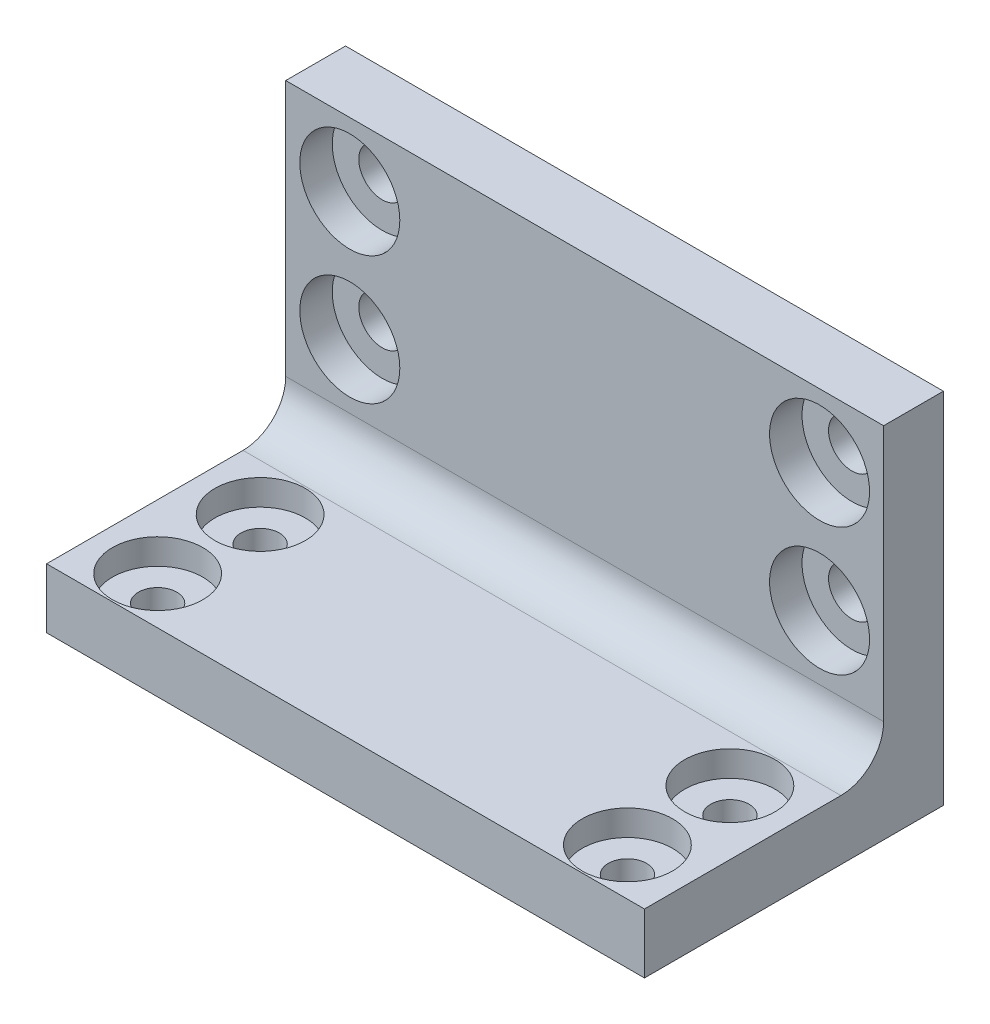
ISO-10303-21;
HEADER;
FILE_DESCRIPTION(('STEP AP214'),'2;1');
FILE_NAME('part.step','',(''),(''),'','','');
FILE_SCHEMA(('AUTOMOTIVE_DESIGN { 1 0 10303 214 1 1 1 1 }'));
ENDSEC;
DATA;
#1=APPLICATION_CONTEXT('core data for automotive mechanical design processes');
#2=APPLICATION_PROTOCOL_DEFINITION('international standard','automotive_design',2000,#1);
#3=PRODUCT_CONTEXT('',#1,'mechanical');
#4=PRODUCT('Part','Part','',(#3));
#5=PRODUCT_RELATED_PRODUCT_CATEGORY('part','',(#4));
#6=PRODUCT_DEFINITION_FORMATION('','',#4);
#7=PRODUCT_DEFINITION_CONTEXT('part definition',#1,'design');
#8=PRODUCT_DEFINITION('design','',#6,#7);
#9=PRODUCT_DEFINITION_SHAPE('','',#8);
#10=(LENGTH_UNIT() NAMED_UNIT(*) SI_UNIT(.MILLI.,.METRE.));
#11=(NAMED_UNIT(*) PLANE_ANGLE_UNIT() SI_UNIT($,.RADIAN.));
#12=(NAMED_UNIT(*) SI_UNIT($,.STERADIAN.) SOLID_ANGLE_UNIT());
#13=UNCERTAINTY_MEASURE_WITH_UNIT(LENGTH_MEASURE(1.E-05),#10,'distance_accuracy_value','');
#14=(GEOMETRIC_REPRESENTATION_CONTEXT(3) GLOBAL_UNCERTAINTY_ASSIGNED_CONTEXT((#13)) GLOBAL_UNIT_ASSIGNED_CONTEXT((#10,
#11,#12)) REPRESENTATION_CONTEXT('',''));
#15=CARTESIAN_POINT('',(0.,0.,0.));
#16=DIRECTION('',(0.,0.,1.));
#17=DIRECTION('',(1.,0.,0.));
#18=AXIS2_PLACEMENT_3D('',#15,#16,#17);
#19=CARTESIAN_POINT('',(-34.9999999999999,7.,35.0000000000001));
#20=DIRECTION('',(1.,0.,0.));
#21=DIRECTION('',(0.,0.,-1.));
#22=AXIS2_PLACEMENT_3D('',#19,#20,#21);
#23=PLANE('',#22);
#24=DIRECTION('',(0.,0.,1.));
#25=VECTOR('',#24,1.);
#26=CARTESIAN_POINT('',(-34.9999999999999,0.,35.0000000000001));
#27=LINE('',#26,#25);
#28=CARTESIAN_POINT('',(-34.9999999999999,0.,1.088711004442E-13));
#29=VERTEX_POINT('',#28);
#30=CARTESIAN_POINT('',(-34.9999999999999,0.,35.0000000000001));
#31=VERTEX_POINT('',#30);
#32=EDGE_CURVE('E116',#29,#31,#27,.T.);
#33=ORIENTED_EDGE('',*,*,#32,.T.);
#34=DIRECTION('',(0.,-1.,0.));
#35=VECTOR('',#34,1.);
#36=CARTESIAN_POINT('',(-34.9999999999999,7.,35.0000000000001));
#37=LINE('',#36,#35);
#38=CARTESIAN_POINT('',(-34.9999999999999,7.,35.0000000000001));
#39=VERTEX_POINT('',#38);
#40=EDGE_CURVE('E142',#39,#31,#37,.T.);
#41=ORIENTED_EDGE('',*,*,#40,.F.);
#42=DIRECTION('',(0.,0.,1.));
#43=VECTOR('',#42,1.);
#44=CARTESIAN_POINT('',(-34.9999999999999,7.,35.0000000000001));
#45=LINE('',#44,#43);
#46=CARTESIAN_POINT('',(-34.9999999999999,7.,12.0000000000001));
#47=VERTEX_POINT('',#46);
#48=EDGE_CURVE('E123',#47,#39,#45,.T.);
#49=ORIENTED_EDGE('',*,*,#48,.F.);
#50=CARTESIAN_POINT('',(-34.9999999999999,12.,12.0000000000001));
#51=DIRECTION('',(1.,0.,0.));
#52=DIRECTION('',(0.,0.,-1.));
#53=AXIS2_PLACEMENT_3D('',#50,#51,#52);
#54=CIRCLE('',#53,5.);
#55=CARTESIAN_POINT('',(-34.9999999999999,12.,7.00000000000011));
#56=VERTEX_POINT('',#55);
#57=EDGE_CURVE('E11',#47,#56,#54,.T.);
#58=ORIENTED_EDGE('',*,*,#57,.T.);
#59=DIRECTION('',(0.,-1.,0.));
#60=VECTOR('',#59,1.);
#61=CARTESIAN_POINT('',(-34.9999999999999,42.,7.00000000000011));
#62=LINE('',#61,#60);
#63=CARTESIAN_POINT('',(-34.9999999999999,42.,7.00000000000011));
#64=VERTEX_POINT('',#63);
#65=EDGE_CURVE('E96',#64,#56,#62,.T.);
#66=ORIENTED_EDGE('',*,*,#65,.F.);
#67=DIRECTION('',(0.,0.,1.));
#68=VECTOR('',#67,1.);
#69=CARTESIAN_POINT('',(-34.9999999999999,42.,7.00000000000011));
#70=LINE('',#69,#68);
#71=CARTESIAN_POINT('',(-34.9999999999999,42.,1.088711004442E-13));
#72=VERTEX_POINT('',#71);
#73=EDGE_CURVE('E103',#72,#64,#70,.T.);
#74=ORIENTED_EDGE('',*,*,#73,.F.);
#75=DIRECTION('',(0.,-1.,0.));
#76=VECTOR('',#75,1.);
#77=CARTESIAN_POINT('',(-34.9999999999999,7.,1.088711004442E-13));
#78=LINE('',#77,#76);
#79=EDGE_CURVE('E129',#72,#29,#78,.T.);
#80=ORIENTED_EDGE('',*,*,#79,.T.);
#81=EDGE_LOOP('',(#33,#41,#49,#58,#66,#74,#80));
#82=FACE_BOUND('',#81,.T.);
#83=ADVANCED_FACE('F33',(#82),#23,.F.);
#84=CARTESIAN_POINT('',(35.0000000000001,7.,35.0000000000001));
#85=DIRECTION('',(0.,0.,-1.));
#86=DIRECTION('',(-1.,0.,0.));
#87=AXIS2_PLACEMENT_3D('',#84,#85,#86);
#88=PLANE('',#87);
#89=DIRECTION('',(1.,0.,0.));
#90=VECTOR('',#89,1.);
#91=CARTESIAN_POINT('',(35.0000000000001,0.,35.0000000000001));
#92=LINE('',#91,#90);
#93=CARTESIAN_POINT('',(35.0000000000001,0.,35.0000000000001));
#94=VERTEX_POINT('',#93);
#95=EDGE_CURVE('E118',#31,#94,#92,.T.);
#96=ORIENTED_EDGE('',*,*,#95,.T.);
#97=DIRECTION('',(0.,-1.,0.));
#98=VECTOR('',#97,1.);
#99=CARTESIAN_POINT('',(35.0000000000001,7.,35.0000000000001));
#100=LINE('',#99,#98);
#101=CARTESIAN_POINT('',(35.0000000000001,7.,35.0000000000001));
#102=VERTEX_POINT('',#101);
#103=EDGE_CURVE('E139',#102,#94,#100,.T.);
#104=ORIENTED_EDGE('',*,*,#103,.F.);
#105=DIRECTION('',(1.,0.,0.));
#106=VECTOR('',#105,1.);
#107=CARTESIAN_POINT('',(35.0000000000001,7.,35.0000000000001));
#108=LINE('',#107,#106);
#109=EDGE_CURVE('E125',#39,#102,#108,.T.);
#110=ORIENTED_EDGE('',*,*,#109,.F.);
#111=ORIENTED_EDGE('',*,*,#40,.T.);
#112=EDGE_LOOP('',(#96,#104,#110,#111));
#113=FACE_BOUND('',#112,.T.);
#114=ADVANCED_FACE('F273',(#113),#88,.F.);
#115=CARTESIAN_POINT('',(35.0000000000001,7.,35.0000000000001));
#116=DIRECTION('',(-1.,0.,0.));
#117=DIRECTION('',(0.,0.,1.));
#118=AXIS2_PLACEMENT_3D('',#115,#116,#117);
#119=PLANE('',#118);
#120=DIRECTION('',(0.,0.,-1.));
#121=VECTOR('',#120,1.);
#122=CARTESIAN_POINT('',(35.0000000000001,0.,35.0000000000001));
#123=LINE('',#122,#121);
#124=CARTESIAN_POINT('',(35.0000000000001,0.,1.00298572850168E-13));
#125=VERTEX_POINT('',#124);
#126=EDGE_CURVE('E132',#94,#125,#123,.T.);
#127=ORIENTED_EDGE('',*,*,#126,.T.);
#128=DIRECTION('',(0.,-1.,0.));
#129=VECTOR('',#128,1.);
#130=CARTESIAN_POINT('',(35.0000000000001,7.,1.00298572850168E-13));
#131=LINE('',#130,#129);
#132=CARTESIAN_POINT('',(34.9999999999999,42.,1.088711004442E-13));
#133=VERTEX_POINT('',#132);
#134=EDGE_CURVE('E136',#133,#125,#131,.T.);
#135=ORIENTED_EDGE('',*,*,#134,.F.);
#136=DIRECTION('',(0.,0.,-1.));
#137=VECTOR('',#136,1.);
#138=CARTESIAN_POINT('',(34.9999999999999,42.,7.0000000000001));
#139=LINE('',#138,#137);
#140=CARTESIAN_POINT('',(34.9999999999999,42.,7.0000000000001));
#141=VERTEX_POINT('',#140);
#142=EDGE_CURVE('E102',#141,#133,#139,.T.);
#143=ORIENTED_EDGE('',*,*,#142,.F.);
#144=DIRECTION('',(0.,-1.,0.));
#145=VECTOR('',#144,1.);
#146=CARTESIAN_POINT('',(34.9999999999999,42.,7.0000000000001));
#147=LINE('',#146,#145);
#148=CARTESIAN_POINT('',(34.9999999999999,12.,7.0000000000001));
#149=VERTEX_POINT('',#148);
#150=EDGE_CURVE('E98',#141,#149,#147,.T.);
#151=ORIENTED_EDGE('',*,*,#150,.T.);
#152=CARTESIAN_POINT('',(35.0000000000001,12.,12.0000000000001));
#153=DIRECTION('',(-1.,0.,0.));
#154=DIRECTION('',(0.,0.,1.));
#155=AXIS2_PLACEMENT_3D('',#152,#153,#154);
#156=CIRCLE('',#155,5.);
#157=CARTESIAN_POINT('',(35.0000000000001,7.,12.0000000000001));
#158=VERTEX_POINT('',#157);
#159=EDGE_CURVE('E41',#149,#158,#156,.T.);
#160=ORIENTED_EDGE('',*,*,#159,.T.);
#161=DIRECTION('',(0.,0.,-1.));
#162=VECTOR('',#161,1.);
#163=CARTESIAN_POINT('',(35.0000000000001,7.,35.0000000000001));
#164=LINE('',#163,#162);
#165=EDGE_CURVE('E128',#102,#158,#164,.T.);
#166=ORIENTED_EDGE('',*,*,#165,.F.);
#167=ORIENTED_EDGE('',*,*,#103,.T.);
#168=EDGE_LOOP('',(#127,#135,#143,#151,#160,#166,#167));
#169=FACE_BOUND('',#168,.T.);
#170=ADVANCED_FACE('F148',(#169),#119,.F.);
#171=CARTESIAN_POINT('',(35.0000000000001,7.,1.00298572850168E-13));
#172=DIRECTION('',(0.,0.,1.));
#173=DIRECTION('',(1.,0.,0.));
#174=AXIS2_PLACEMENT_3D('',#171,#172,#173);
#175=PLANE('',#174);
#176=CARTESIAN_POINT('',(-27.5,34.5,1.01481323344643E-13));
#177=DIRECTION('',(0.,0.,1.));
#178=DIRECTION('',(1.,0.,0.));
#179=AXIS2_PLACEMENT_3D('',#176,#177,#178);
#180=CIRCLE('',#179,2.75);
#181=CARTESIAN_POINT('',(-24.75,34.5,1.01481323344643E-13));
#182=VERTEX_POINT('',#181);
#183=EDGE_CURVE('E186',#182,#182,#180,.T.);
#184=ORIENTED_EDGE('',*,*,#183,.T.);
#185=EDGE_LOOP('',(#184));
#186=FACE_BOUND('',#185,.T.);
#187=CARTESIAN_POINT('',(27.5,34.5,1.01481323344643E-13));
#188=DIRECTION('',(0.,0.,1.));
#189=DIRECTION('',(1.,0.,0.));
#190=AXIS2_PLACEMENT_3D('',#187,#188,#189);
#191=CIRCLE('',#190,2.75);
#192=CARTESIAN_POINT('',(30.25,34.5,1.01481323344643E-13));
#193=VERTEX_POINT('',#192);
#194=EDGE_CURVE('E174',#193,#193,#191,.T.);
#195=ORIENTED_EDGE('',*,*,#194,.T.);
#196=EDGE_LOOP('',(#195));
#197=FACE_BOUND('',#196,.T.);
#198=CARTESIAN_POINT('',(27.5,19.5,1.01481323344643E-13));
#199=DIRECTION('',(0.,0.,1.));
#200=DIRECTION('',(1.,0.,0.));
#201=AXIS2_PLACEMENT_3D('',#198,#199,#200);
#202=CIRCLE('',#201,2.75);
#203=CARTESIAN_POINT('',(30.25,19.5,1.01481323344643E-13));
#204=VERTEX_POINT('',#203);
#205=EDGE_CURVE('E162',#204,#204,#202,.T.);
#206=ORIENTED_EDGE('',*,*,#205,.T.);
#207=EDGE_LOOP('',(#206));
#208=FACE_BOUND('',#207,.T.);
#209=CARTESIAN_POINT('',(-27.5,19.5,1.01481323344643E-13));
#210=DIRECTION('',(0.,0.,1.));
#211=DIRECTION('',(1.,0.,0.));
#212=AXIS2_PLACEMENT_3D('',#209,#210,#211);
#213=CIRCLE('',#212,2.75);
#214=CARTESIAN_POINT('',(-24.75,19.5,1.01481323344643E-13));
#215=VERTEX_POINT('',#214);
#216=EDGE_CURVE('E112',#215,#215,#213,.T.);
#217=ORIENTED_EDGE('',*,*,#216,.T.);
#218=EDGE_LOOP('',(#217));
#219=FACE_BOUND('',#218,.T.);
#220=DIRECTION('',(-1.,0.,0.));
#221=VECTOR('',#220,1.);
#222=CARTESIAN_POINT('',(35.0000000000001,0.,1.00298572850168E-13));
#223=LINE('',#222,#221);
#224=EDGE_CURVE('E126',#125,#29,#223,.T.);
#225=ORIENTED_EDGE('',*,*,#224,.T.);
#226=ORIENTED_EDGE('',*,*,#79,.F.);
#227=DIRECTION('',(-1.,0.,0.));
#228=VECTOR('',#227,1.);
#229=CARTESIAN_POINT('',(34.9999999999999,42.,1.088711004442E-13));
#230=LINE('',#229,#228);
#231=EDGE_CURVE('E109',#133,#72,#230,.T.);
#232=ORIENTED_EDGE('',*,*,#231,.F.);
#233=ORIENTED_EDGE('',*,*,#134,.T.);
#234=EDGE_LOOP('',(#225,#226,#232,#233));
#235=FACE_BOUND('',#234,.T.);
#236=ADVANCED_FACE('F253',(#186,#197,#208,#219,#235),#175,.F.);
#237=CARTESIAN_POINT('',(0.,7.,0.));
#238=DIRECTION('',(0.,1.,0.));
#239=DIRECTION('',(0.,0.,1.));
#240=AXIS2_PLACEMENT_3D('',#237,#238,#239);
#241=PLANE('',#240);
#242=CARTESIAN_POINT('',(-27.5,7.,17.5000000000001));
#243=DIRECTION('',(0.,1.,0.));
#244=DIRECTION('',(0.,0.,1.));
#245=AXIS2_PLACEMENT_3D('',#242,#243,#244);
#246=CIRCLE('',#245,5.295);
#247=CARTESIAN_POINT('',(-27.5,7.,22.7950000000001));
#248=VERTEX_POINT('',#247);
#249=EDGE_CURVE('E243',#248,#248,#246,.T.);
#250=ORIENTED_EDGE('',*,*,#249,.F.);
#251=EDGE_LOOP('',(#250));
#252=FACE_BOUND('',#251,.T.);
#253=CARTESIAN_POINT('',(-27.5,7.,29.5000000000001));
#254=DIRECTION('',(0.,1.,0.));
#255=DIRECTION('',(0.,0.,1.));
#256=AXIS2_PLACEMENT_3D('',#253,#254,#255);
#257=CIRCLE('',#256,5.295);
#258=CARTESIAN_POINT('',(-27.5,7.,34.7950000000001));
#259=VERTEX_POINT('',#258);
#260=EDGE_CURVE('E231',#259,#259,#257,.T.);
#261=ORIENTED_EDGE('',*,*,#260,.F.);
#262=EDGE_LOOP('',(#261));
#263=FACE_BOUND('',#262,.T.);
#264=CARTESIAN_POINT('',(27.5,7.,17.5000000000001));
#265=DIRECTION('',(0.,1.,0.));
#266=DIRECTION('',(0.,0.,1.));
#267=AXIS2_PLACEMENT_3D('',#264,#265,#266);
#268=CIRCLE('',#267,5.295);
#269=CARTESIAN_POINT('',(27.5,7.,22.7950000000001));
#270=VERTEX_POINT('',#269);
#271=EDGE_CURVE('E219',#270,#270,#268,.T.);
#272=ORIENTED_EDGE('',*,*,#271,.F.);
#273=EDGE_LOOP('',(#272));
#274=FACE_BOUND('',#273,.T.);
#275=CARTESIAN_POINT('',(27.5,7.,29.5000000000001));
#276=DIRECTION('',(0.,1.,0.));
#277=DIRECTION('',(0.,0.,1.));
#278=AXIS2_PLACEMENT_3D('',#275,#276,#277);
#279=CIRCLE('',#278,5.295);
#280=CARTESIAN_POINT('',(27.5,7.,34.7950000000001));
#281=VERTEX_POINT('',#280);
#282=EDGE_CURVE('E207',#281,#281,#279,.T.);
#283=ORIENTED_EDGE('',*,*,#282,.F.);
#284=EDGE_LOOP('',(#283));
#285=FACE_BOUND('',#284,.T.);
#286=ORIENTED_EDGE('',*,*,#165,.T.);
#287=DIRECTION('',(1.,0.,0.));
#288=VECTOR('',#287,1.);
#289=CARTESIAN_POINT('',(0.,7.,12.0000000000001));
#290=LINE('',#289,#288);
#291=EDGE_CURVE('E54',#158,#47,#290,.F.);
#292=ORIENTED_EDGE('',*,*,#291,.T.);
#293=ORIENTED_EDGE('',*,*,#48,.T.);
#294=ORIENTED_EDGE('',*,*,#109,.T.);
#295=EDGE_LOOP('',(#286,#292,#293,#294));
#296=FACE_BOUND('',#295,.T.);
#297=ADVANCED_FACE('F249',(#252,#263,#274,#285,#296),#241,.T.);
#298=CARTESIAN_POINT('',(0.,0.,0.));
#299=DIRECTION('',(0.,1.,0.));
#300=DIRECTION('',(0.,0.,1.));
#301=AXIS2_PLACEMENT_3D('',#298,#299,#300);
#302=PLANE('',#301);
#303=CARTESIAN_POINT('',(-27.5,0.,17.5000000000001));
#304=DIRECTION('',(0.,1.,0.));
#305=DIRECTION('',(0.,0.,1.));
#306=AXIS2_PLACEMENT_3D('',#303,#304,#305);
#307=CIRCLE('',#306,2.25);
#308=CARTESIAN_POINT('',(-27.5,0.,19.7500000000001));
#309=VERTEX_POINT('',#308);
#310=EDGE_CURVE('E234',#309,#309,#307,.T.);
#311=ORIENTED_EDGE('',*,*,#310,.T.);
#312=EDGE_LOOP('',(#311));
#313=FACE_BOUND('',#312,.T.);
#314=CARTESIAN_POINT('',(-27.5,0.,29.5000000000001));
#315=DIRECTION('',(0.,1.,0.));
#316=DIRECTION('',(0.,0.,1.));
#317=AXIS2_PLACEMENT_3D('',#314,#315,#316);
#318=CIRCLE('',#317,2.25);
#319=CARTESIAN_POINT('',(-27.5,0.,31.7500000000001));
#320=VERTEX_POINT('',#319);
#321=EDGE_CURVE('E222',#320,#320,#318,.T.);
#322=ORIENTED_EDGE('',*,*,#321,.T.);
#323=EDGE_LOOP('',(#322));
#324=FACE_BOUND('',#323,.T.);
#325=CARTESIAN_POINT('',(27.5,0.,17.5000000000001));
#326=DIRECTION('',(0.,1.,0.));
#327=DIRECTION('',(0.,0.,1.));
#328=AXIS2_PLACEMENT_3D('',#325,#326,#327);
#329=CIRCLE('',#328,2.25);
#330=CARTESIAN_POINT('',(27.5,0.,19.7500000000001));
#331=VERTEX_POINT('',#330);
#332=EDGE_CURVE('E210',#331,#331,#329,.T.);
#333=ORIENTED_EDGE('',*,*,#332,.T.);
#334=EDGE_LOOP('',(#333));
#335=FACE_BOUND('',#334,.T.);
#336=CARTESIAN_POINT('',(27.5,0.,29.5000000000001));
#337=DIRECTION('',(0.,1.,0.));
#338=DIRECTION('',(0.,0.,1.));
#339=AXIS2_PLACEMENT_3D('',#336,#337,#338);
#340=CIRCLE('',#339,2.25);
#341=CARTESIAN_POINT('',(27.5,0.,31.7500000000001));
#342=VERTEX_POINT('',#341);
#343=EDGE_CURVE('E198',#342,#342,#340,.T.);
#344=ORIENTED_EDGE('',*,*,#343,.T.);
#345=EDGE_LOOP('',(#344));
#346=FACE_BOUND('',#345,.T.);
#347=ORIENTED_EDGE('',*,*,#32,.F.);
#348=ORIENTED_EDGE('',*,*,#224,.F.);
#349=ORIENTED_EDGE('',*,*,#126,.F.);
#350=ORIENTED_EDGE('',*,*,#95,.F.);
#351=EDGE_LOOP('',(#347,#348,#349,#350));
#352=FACE_BOUND('',#351,.T.);
#353=ADVANCED_FACE('F252',(#313,#324,#335,#346,#352),#302,.F.);
#354=CARTESIAN_POINT('',(34.9999999999999,42.,7.0000000000001));
#355=DIRECTION('',(0.,0.,-1.));
#356=DIRECTION('',(-1.,0.,0.));
#357=AXIS2_PLACEMENT_3D('',#354,#355,#356);
#358=PLANE('',#357);
#359=CARTESIAN_POINT('',(-27.5,34.5,7.0000000000001));
#360=DIRECTION('',(0.,0.,1.));
#361=DIRECTION('',(1.,0.,0.));
#362=AXIS2_PLACEMENT_3D('',#359,#360,#361);
#363=CIRCLE('',#362,5.855);
#364=CARTESIAN_POINT('',(-21.645,34.5,7.0000000000001));
#365=VERTEX_POINT('',#364);
#366=EDGE_CURVE('E195',#365,#365,#363,.T.);
#367=ORIENTED_EDGE('',*,*,#366,.F.);
#368=EDGE_LOOP('',(#367));
#369=FACE_BOUND('',#368,.T.);
#370=CARTESIAN_POINT('',(27.5,34.5,7.0000000000001));
#371=DIRECTION('',(0.,0.,1.));
#372=DIRECTION('',(1.,0.,0.));
#373=AXIS2_PLACEMENT_3D('',#370,#371,#372);
#374=CIRCLE('',#373,5.855);
#375=CARTESIAN_POINT('',(33.355,34.5,7.0000000000001));
#376=VERTEX_POINT('',#375);
#377=EDGE_CURVE('E183',#376,#376,#374,.T.);
#378=ORIENTED_EDGE('',*,*,#377,.F.);
#379=EDGE_LOOP('',(#378));
#380=FACE_BOUND('',#379,.T.);
#381=CARTESIAN_POINT('',(27.5,19.5,7.0000000000001));
#382=DIRECTION('',(0.,0.,1.));
#383=DIRECTION('',(1.,0.,0.));
#384=AXIS2_PLACEMENT_3D('',#381,#382,#383);
#385=CIRCLE('',#384,5.855);
#386=CARTESIAN_POINT('',(33.355,19.5,7.0000000000001));
#387=VERTEX_POINT('',#386);
#388=EDGE_CURVE('E171',#387,#387,#385,.T.);
#389=ORIENTED_EDGE('',*,*,#388,.F.);
#390=EDGE_LOOP('',(#389));
#391=FACE_BOUND('',#390,.T.);
#392=CARTESIAN_POINT('',(-27.5,19.5,7.0000000000001));
#393=DIRECTION('',(0.,0.,1.));
#394=DIRECTION('',(1.,0.,0.));
#395=AXIS2_PLACEMENT_3D('',#392,#393,#394);
#396=CIRCLE('',#395,5.855);
#397=CARTESIAN_POINT('',(-21.645,19.5,7.0000000000001));
#398=VERTEX_POINT('',#397);
#399=EDGE_CURVE('E159',#398,#398,#396,.T.);
#400=ORIENTED_EDGE('',*,*,#399,.F.);
#401=EDGE_LOOP('',(#400));
#402=FACE_BOUND('',#401,.T.);
#403=ORIENTED_EDGE('',*,*,#65,.T.);
#404=DIRECTION('',(1.,0.,0.));
#405=VECTOR('',#404,1.);
#406=CARTESIAN_POINT('',(34.9999999999999,12.,7.0000000000001));
#407=LINE('',#406,#405);
#408=EDGE_CURVE('E145',#56,#149,#407,.T.);
#409=ORIENTED_EDGE('',*,*,#408,.T.);
#410=ORIENTED_EDGE('',*,*,#150,.F.);
#411=DIRECTION('',(1.,0.,0.));
#412=VECTOR('',#411,1.);
#413=CARTESIAN_POINT('',(34.9999999999999,42.,7.0000000000001));
#414=LINE('',#413,#412);
#415=EDGE_CURVE('E91',#64,#141,#414,.T.);
#416=ORIENTED_EDGE('',*,*,#415,.F.);
#417=EDGE_LOOP('',(#403,#409,#410,#416));
#418=FACE_BOUND('',#417,.T.);
#419=ADVANCED_FACE('F93',(#369,#380,#391,#402,#418),#358,.F.);
#420=CARTESIAN_POINT('',(0.,42.,0.));
#421=DIRECTION('',(0.,1.,0.));
#422=DIRECTION('',(0.,0.,1.));
#423=AXIS2_PLACEMENT_3D('',#420,#421,#422);
#424=PLANE('',#423);
#425=ORIENTED_EDGE('',*,*,#73,.T.);
#426=ORIENTED_EDGE('',*,*,#415,.T.);
#427=ORIENTED_EDGE('',*,*,#142,.T.);
#428=ORIENTED_EDGE('',*,*,#231,.T.);
#429=EDGE_LOOP('',(#425,#426,#427,#428));
#430=FACE_BOUND('',#429,.T.);
#431=ADVANCED_FACE('F107',(#430),#424,.T.);
#432=CARTESIAN_POINT('',(34.9999999999999,12.,12.0000000000001));
#433=DIRECTION('',(1.,0.,0.));
#434=DIRECTION('',(0.,0.,-1.));
#435=AXIS2_PLACEMENT_3D('',#432,#433,#434);
#436=CYLINDRICAL_SURFACE('',#435,5.);
#437=ORIENTED_EDGE('',*,*,#57,.F.);
#438=ORIENTED_EDGE('',*,*,#291,.F.);
#439=ORIENTED_EDGE('',*,*,#159,.F.);
#440=ORIENTED_EDGE('',*,*,#408,.F.);
#441=EDGE_LOOP('',(#437,#438,#439,#440));
#442=FACE_BOUND('',#441,.T.);
#443=ADVANCED_FACE('F35',(#442),#436,.F.);
#444=CARTESIAN_POINT('',(-27.5,19.5,7.0000000000001));
#445=DIRECTION('',(0.,0.,1.));
#446=DIRECTION('',(1.,0.,0.));
#447=AXIS2_PLACEMENT_3D('',#444,#445,#446);
#448=CYLINDRICAL_SURFACE('',#447,2.75);
#449=ORIENTED_EDGE('',*,*,#216,.F.);
#450=EDGE_LOOP('',(#449));
#451=FACE_BOUND('',#450,.T.);
#452=CARTESIAN_POINT('',(-27.5,19.5,3.20000000000011));
#453=DIRECTION('',(0.,0.,1.));
#454=DIRECTION('',(1.,0.,0.));
#455=AXIS2_PLACEMENT_3D('',#452,#453,#454);
#456=CIRCLE('',#455,2.75);
#457=CARTESIAN_POINT('',(-24.75,19.5,3.20000000000011));
#458=VERTEX_POINT('',#457);
#459=EDGE_CURVE('E153',#458,#458,#456,.T.);
#460=ORIENTED_EDGE('',*,*,#459,.T.);
#461=EDGE_LOOP('',(#460));
#462=FACE_BOUND('',#461,.T.);
#463=ADVANCED_FACE('F263',(#451,#462),#448,.F.);
#464=CARTESIAN_POINT('',(-24.75,19.5,3.20000000000011));
#465=DIRECTION('',(0.,0.,-1.));
#466=DIRECTION('',(-1.,0.,0.));
#467=AXIS2_PLACEMENT_3D('',#464,#465,#466);
#468=PLANE('',#467);
#469=ORIENTED_EDGE('',*,*,#459,.F.);
#470=EDGE_LOOP('',(#469));
#471=FACE_BOUND('',#470,.T.);
#472=CARTESIAN_POINT('',(-27.5,19.5,3.20000000000011));
#473=DIRECTION('',(0.,0.,1.));
#474=DIRECTION('',(1.,0.,0.));
#475=AXIS2_PLACEMENT_3D('',#472,#473,#474);
#476=CIRCLE('',#475,5.855);
#477=CARTESIAN_POINT('',(-21.645,19.5,3.20000000000011));
#478=VERTEX_POINT('',#477);
#479=EDGE_CURVE('E156',#478,#478,#476,.T.);
#480=ORIENTED_EDGE('',*,*,#479,.T.);
#481=EDGE_LOOP('',(#480));
#482=FACE_BOUND('',#481,.T.);
#483=ADVANCED_FACE('F268',(#471,#482),#468,.F.);
#484=CARTESIAN_POINT('',(-27.5,19.5,7.0000000000001));
#485=DIRECTION('',(0.,0.,1.));
#486=DIRECTION('',(1.,0.,0.));
#487=AXIS2_PLACEMENT_3D('',#484,#485,#486);
#488=CYLINDRICAL_SURFACE('',#487,5.855);
#489=ORIENTED_EDGE('',*,*,#479,.F.);
#490=EDGE_LOOP('',(#489));
#491=FACE_BOUND('',#490,.T.);
#492=ORIENTED_EDGE('',*,*,#399,.T.);
#493=EDGE_LOOP('',(#492));
#494=FACE_BOUND('',#493,.T.);
#495=ADVANCED_FACE('F293',(#491,#494),#488,.F.);
#496=CARTESIAN_POINT('',(27.5,19.5,7.0000000000001));
#497=DIRECTION('',(0.,0.,1.));
#498=DIRECTION('',(1.,0.,0.));
#499=AXIS2_PLACEMENT_3D('',#496,#497,#498);
#500=CYLINDRICAL_SURFACE('',#499,2.75);
#501=ORIENTED_EDGE('',*,*,#205,.F.);
#502=EDGE_LOOP('',(#501));
#503=FACE_BOUND('',#502,.T.);
#504=CARTESIAN_POINT('',(27.5,19.5,3.20000000000011));
#505=DIRECTION('',(0.,0.,1.));
#506=DIRECTION('',(1.,0.,0.));
#507=AXIS2_PLACEMENT_3D('',#504,#505,#506);
#508=CIRCLE('',#507,2.75);
#509=CARTESIAN_POINT('',(30.25,19.5,3.20000000000011));
#510=VERTEX_POINT('',#509);
#511=EDGE_CURVE('E165',#510,#510,#508,.T.);
#512=ORIENTED_EDGE('',*,*,#511,.T.);
#513=EDGE_LOOP('',(#512));
#514=FACE_BOUND('',#513,.T.);
#515=ADVANCED_FACE('F297',(#503,#514),#500,.F.);
#516=CARTESIAN_POINT('',(30.25,19.5,3.20000000000011));
#517=DIRECTION('',(0.,0.,-1.));
#518=DIRECTION('',(-1.,0.,0.));
#519=AXIS2_PLACEMENT_3D('',#516,#517,#518);
#520=PLANE('',#519);
#521=ORIENTED_EDGE('',*,*,#511,.F.);
#522=EDGE_LOOP('',(#521));
#523=FACE_BOUND('',#522,.T.);
#524=CARTESIAN_POINT('',(27.5,19.5,3.20000000000011));
#525=DIRECTION('',(0.,0.,1.));
#526=DIRECTION('',(1.,0.,0.));
#527=AXIS2_PLACEMENT_3D('',#524,#525,#526);
#528=CIRCLE('',#527,5.855);
#529=CARTESIAN_POINT('',(33.355,19.5,3.20000000000011));
#530=VERTEX_POINT('',#529);
#531=EDGE_CURVE('E168',#530,#530,#528,.T.);
#532=ORIENTED_EDGE('',*,*,#531,.T.);
#533=EDGE_LOOP('',(#532));
#534=FACE_BOUND('',#533,.T.);
#535=ADVANCED_FACE('F301',(#523,#534),#520,.F.);
#536=CARTESIAN_POINT('',(27.5,19.5,7.0000000000001));
#537=DIRECTION('',(0.,0.,1.));
#538=DIRECTION('',(1.,0.,0.));
#539=AXIS2_PLACEMENT_3D('',#536,#537,#538);
#540=CYLINDRICAL_SURFACE('',#539,5.855);
#541=ORIENTED_EDGE('',*,*,#531,.F.);
#542=EDGE_LOOP('',(#541));
#543=FACE_BOUND('',#542,.T.);
#544=ORIENTED_EDGE('',*,*,#388,.T.);
#545=EDGE_LOOP('',(#544));
#546=FACE_BOUND('',#545,.T.);
#547=ADVANCED_FACE('F305',(#543,#546),#540,.F.);
#548=CARTESIAN_POINT('',(27.5,34.5,7.0000000000001));
#549=DIRECTION('',(0.,0.,1.));
#550=DIRECTION('',(1.,0.,0.));
#551=AXIS2_PLACEMENT_3D('',#548,#549,#550);
#552=CYLINDRICAL_SURFACE('',#551,2.75);
#553=ORIENTED_EDGE('',*,*,#194,.F.);
#554=EDGE_LOOP('',(#553));
#555=FACE_BOUND('',#554,.T.);
#556=CARTESIAN_POINT('',(27.5,34.5,3.20000000000011));
#557=DIRECTION('',(0.,0.,1.));
#558=DIRECTION('',(1.,0.,0.));
#559=AXIS2_PLACEMENT_3D('',#556,#557,#558);
#560=CIRCLE('',#559,2.75);
#561=CARTESIAN_POINT('',(30.25,34.5,3.20000000000011));
#562=VERTEX_POINT('',#561);
#563=EDGE_CURVE('E177',#562,#562,#560,.T.);
#564=ORIENTED_EDGE('',*,*,#563,.T.);
#565=EDGE_LOOP('',(#564));
#566=FACE_BOUND('',#565,.T.);
#567=ADVANCED_FACE('F309',(#555,#566),#552,.F.);
#568=CARTESIAN_POINT('',(30.25,34.5,3.20000000000011));
#569=DIRECTION('',(0.,0.,-1.));
#570=DIRECTION('',(-1.,0.,0.));
#571=AXIS2_PLACEMENT_3D('',#568,#569,#570);
#572=PLANE('',#571);
#573=ORIENTED_EDGE('',*,*,#563,.F.);
#574=EDGE_LOOP('',(#573));
#575=FACE_BOUND('',#574,.T.);
#576=CARTESIAN_POINT('',(27.5,34.5,3.20000000000011));
#577=DIRECTION('',(0.,0.,1.));
#578=DIRECTION('',(1.,0.,0.));
#579=AXIS2_PLACEMENT_3D('',#576,#577,#578);
#580=CIRCLE('',#579,5.855);
#581=CARTESIAN_POINT('',(33.355,34.5,3.20000000000011));
#582=VERTEX_POINT('',#581);
#583=EDGE_CURVE('E180',#582,#582,#580,.T.);
#584=ORIENTED_EDGE('',*,*,#583,.T.);
#585=EDGE_LOOP('',(#584));
#586=FACE_BOUND('',#585,.T.);
#587=ADVANCED_FACE('F313',(#575,#586),#572,.F.);
#588=CARTESIAN_POINT('',(27.5,34.5,7.0000000000001));
#589=DIRECTION('',(0.,0.,1.));
#590=DIRECTION('',(1.,0.,0.));
#591=AXIS2_PLACEMENT_3D('',#588,#589,#590);
#592=CYLINDRICAL_SURFACE('',#591,5.855);
#593=ORIENTED_EDGE('',*,*,#583,.F.);
#594=EDGE_LOOP('',(#593));
#595=FACE_BOUND('',#594,.T.);
#596=ORIENTED_EDGE('',*,*,#377,.T.);
#597=EDGE_LOOP('',(#596));
#598=FACE_BOUND('',#597,.T.);
#599=ADVANCED_FACE('F317',(#595,#598),#592,.F.);
#600=CARTESIAN_POINT('',(-27.5,34.5,7.0000000000001));
#601=DIRECTION('',(0.,0.,1.));
#602=DIRECTION('',(1.,0.,0.));
#603=AXIS2_PLACEMENT_3D('',#600,#601,#602);
#604=CYLINDRICAL_SURFACE('',#603,2.75);
#605=ORIENTED_EDGE('',*,*,#183,.F.);
#606=EDGE_LOOP('',(#605));
#607=FACE_BOUND('',#606,.T.);
#608=CARTESIAN_POINT('',(-27.5,34.5,3.20000000000011));
#609=DIRECTION('',(0.,0.,1.));
#610=DIRECTION('',(1.,0.,0.));
#611=AXIS2_PLACEMENT_3D('',#608,#609,#610);
#612=CIRCLE('',#611,2.75);
#613=CARTESIAN_POINT('',(-24.75,34.5,3.20000000000011));
#614=VERTEX_POINT('',#613);
#615=EDGE_CURVE('E189',#614,#614,#612,.T.);
#616=ORIENTED_EDGE('',*,*,#615,.T.);
#617=EDGE_LOOP('',(#616));
#618=FACE_BOUND('',#617,.T.);
#619=ADVANCED_FACE('F321',(#607,#618),#604,.F.);
#620=CARTESIAN_POINT('',(-24.75,34.5,3.20000000000011));
#621=DIRECTION('',(0.,0.,-1.));
#622=DIRECTION('',(-1.,0.,0.));
#623=AXIS2_PLACEMENT_3D('',#620,#621,#622);
#624=PLANE('',#623);
#625=ORIENTED_EDGE('',*,*,#615,.F.);
#626=EDGE_LOOP('',(#625));
#627=FACE_BOUND('',#626,.T.);
#628=CARTESIAN_POINT('',(-27.5,34.5,3.20000000000011));
#629=DIRECTION('',(0.,0.,1.));
#630=DIRECTION('',(1.,0.,0.));
#631=AXIS2_PLACEMENT_3D('',#628,#629,#630);
#632=CIRCLE('',#631,5.855);
#633=CARTESIAN_POINT('',(-21.645,34.5,3.20000000000011));
#634=VERTEX_POINT('',#633);
#635=EDGE_CURVE('E192',#634,#634,#632,.T.);
#636=ORIENTED_EDGE('',*,*,#635,.T.);
#637=EDGE_LOOP('',(#636));
#638=FACE_BOUND('',#637,.T.);
#639=ADVANCED_FACE('F325',(#627,#638),#624,.F.);
#640=CARTESIAN_POINT('',(-27.5,34.5,7.0000000000001));
#641=DIRECTION('',(0.,0.,1.));
#642=DIRECTION('',(1.,0.,0.));
#643=AXIS2_PLACEMENT_3D('',#640,#641,#642);
#644=CYLINDRICAL_SURFACE('',#643,5.855);
#645=ORIENTED_EDGE('',*,*,#635,.F.);
#646=EDGE_LOOP('',(#645));
#647=FACE_BOUND('',#646,.T.);
#648=ORIENTED_EDGE('',*,*,#366,.T.);
#649=EDGE_LOOP('',(#648));
#650=FACE_BOUND('',#649,.T.);
#651=ADVANCED_FACE('F329',(#647,#650),#644,.F.);
#652=CARTESIAN_POINT('',(27.5,7.,29.5000000000001));
#653=DIRECTION('',(0.,1.,0.));
#654=DIRECTION('',(0.,0.,1.));
#655=AXIS2_PLACEMENT_3D('',#652,#653,#654);
#656=CYLINDRICAL_SURFACE('',#655,2.25);
#657=ORIENTED_EDGE('',*,*,#343,.F.);
#658=EDGE_LOOP('',(#657));
#659=FACE_BOUND('',#658,.T.);
#660=CARTESIAN_POINT('',(27.5,4.,29.5000000000001));
#661=DIRECTION('',(0.,1.,0.));
#662=DIRECTION('',(0.,0.,1.));
#663=AXIS2_PLACEMENT_3D('',#660,#661,#662);
#664=CIRCLE('',#663,2.25);
#665=CARTESIAN_POINT('',(27.5,4.,31.7500000000001));
#666=VERTEX_POINT('',#665);
#667=EDGE_CURVE('E201',#666,#666,#664,.T.);
#668=ORIENTED_EDGE('',*,*,#667,.T.);
#669=EDGE_LOOP('',(#668));
#670=FACE_BOUND('',#669,.T.);
#671=ADVANCED_FACE('F333',(#659,#670),#656,.F.);
#672=CARTESIAN_POINT('',(29.75,4.,29.5000000000001));
#673=DIRECTION('',(0.,-1.,0.));
#674=DIRECTION('',(0.,0.,-1.));
#675=AXIS2_PLACEMENT_3D('',#672,#673,#674);
#676=PLANE('',#675);
#677=ORIENTED_EDGE('',*,*,#667,.F.);
#678=EDGE_LOOP('',(#677));
#679=FACE_BOUND('',#678,.T.);
#680=CARTESIAN_POINT('',(27.5,4.,29.5000000000001));
#681=DIRECTION('',(0.,1.,0.));
#682=DIRECTION('',(0.,0.,1.));
#683=AXIS2_PLACEMENT_3D('',#680,#681,#682);
#684=CIRCLE('',#683,5.295);
#685=CARTESIAN_POINT('',(27.5,4.,34.7950000000001));
#686=VERTEX_POINT('',#685);
#687=EDGE_CURVE('E204',#686,#686,#684,.T.);
#688=ORIENTED_EDGE('',*,*,#687,.T.);
#689=EDGE_LOOP('',(#688));
#690=FACE_BOUND('',#689,.T.);
#691=ADVANCED_FACE('F337',(#679,#690),#676,.F.);
#692=CARTESIAN_POINT('',(27.5,7.,29.5000000000001));
#693=DIRECTION('',(0.,1.,0.));
#694=DIRECTION('',(0.,0.,1.));
#695=AXIS2_PLACEMENT_3D('',#692,#693,#694);
#696=CYLINDRICAL_SURFACE('',#695,5.295);
#697=ORIENTED_EDGE('',*,*,#687,.F.);
#698=EDGE_LOOP('',(#697));
#699=FACE_BOUND('',#698,.T.);
#700=ORIENTED_EDGE('',*,*,#282,.T.);
#701=EDGE_LOOP('',(#700));
#702=FACE_BOUND('',#701,.T.);
#703=ADVANCED_FACE('F341',(#699,#702),#696,.F.);
#704=CARTESIAN_POINT('',(27.5,7.,17.5000000000001));
#705=DIRECTION('',(0.,1.,0.));
#706=DIRECTION('',(0.,0.,1.));
#707=AXIS2_PLACEMENT_3D('',#704,#705,#706);
#708=CYLINDRICAL_SURFACE('',#707,2.25);
#709=ORIENTED_EDGE('',*,*,#332,.F.);
#710=EDGE_LOOP('',(#709));
#711=FACE_BOUND('',#710,.T.);
#712=CARTESIAN_POINT('',(27.5,4.,17.5000000000001));
#713=DIRECTION('',(0.,1.,0.));
#714=DIRECTION('',(0.,0.,1.));
#715=AXIS2_PLACEMENT_3D('',#712,#713,#714);
#716=CIRCLE('',#715,2.25);
#717=CARTESIAN_POINT('',(27.5,4.,19.7500000000001));
#718=VERTEX_POINT('',#717);
#719=EDGE_CURVE('E213',#718,#718,#716,.T.);
#720=ORIENTED_EDGE('',*,*,#719,.T.);
#721=EDGE_LOOP('',(#720));
#722=FACE_BOUND('',#721,.T.);
#723=ADVANCED_FACE('F345',(#711,#722),#708,.F.);
#724=CARTESIAN_POINT('',(29.75,4.,17.5000000000001));
#725=DIRECTION('',(0.,-1.,0.));
#726=DIRECTION('',(0.,0.,-1.));
#727=AXIS2_PLACEMENT_3D('',#724,#725,#726);
#728=PLANE('',#727);
#729=ORIENTED_EDGE('',*,*,#719,.F.);
#730=EDGE_LOOP('',(#729));
#731=FACE_BOUND('',#730,.T.);
#732=CARTESIAN_POINT('',(27.5,4.,17.5000000000001));
#733=DIRECTION('',(0.,1.,0.));
#734=DIRECTION('',(0.,0.,1.));
#735=AXIS2_PLACEMENT_3D('',#732,#733,#734);
#736=CIRCLE('',#735,5.295);
#737=CARTESIAN_POINT('',(27.5,4.,22.7950000000001));
#738=VERTEX_POINT('',#737);
#739=EDGE_CURVE('E216',#738,#738,#736,.T.);
#740=ORIENTED_EDGE('',*,*,#739,.T.);
#741=EDGE_LOOP('',(#740));
#742=FACE_BOUND('',#741,.T.);
#743=ADVANCED_FACE('F349',(#731,#742),#728,.F.);
#744=CARTESIAN_POINT('',(27.5,7.,17.5000000000001));
#745=DIRECTION('',(0.,1.,0.));
#746=DIRECTION('',(0.,0.,1.));
#747=AXIS2_PLACEMENT_3D('',#744,#745,#746);
#748=CYLINDRICAL_SURFACE('',#747,5.295);
#749=ORIENTED_EDGE('',*,*,#739,.F.);
#750=EDGE_LOOP('',(#749));
#751=FACE_BOUND('',#750,.T.);
#752=ORIENTED_EDGE('',*,*,#271,.T.);
#753=EDGE_LOOP('',(#752));
#754=FACE_BOUND('',#753,.T.);
#755=ADVANCED_FACE('F353',(#751,#754),#748,.F.);
#756=CARTESIAN_POINT('',(-27.5,7.,29.5000000000001));
#757=DIRECTION('',(0.,1.,0.));
#758=DIRECTION('',(0.,0.,1.));
#759=AXIS2_PLACEMENT_3D('',#756,#757,#758);
#760=CYLINDRICAL_SURFACE('',#759,2.25);
#761=ORIENTED_EDGE('',*,*,#321,.F.);
#762=EDGE_LOOP('',(#761));
#763=FACE_BOUND('',#762,.T.);
#764=CARTESIAN_POINT('',(-27.5,4.,29.5000000000001));
#765=DIRECTION('',(0.,1.,0.));
#766=DIRECTION('',(0.,0.,1.));
#767=AXIS2_PLACEMENT_3D('',#764,#765,#766);
#768=CIRCLE('',#767,2.25);
#769=CARTESIAN_POINT('',(-27.5,4.,31.7500000000001));
#770=VERTEX_POINT('',#769);
#771=EDGE_CURVE('E225',#770,#770,#768,.T.);
#772=ORIENTED_EDGE('',*,*,#771,.T.);
#773=EDGE_LOOP('',(#772));
#774=FACE_BOUND('',#773,.T.);
#775=ADVANCED_FACE('F357',(#763,#774),#760,.F.);
#776=CARTESIAN_POINT('',(-25.25,4.,29.5000000000001));
#777=DIRECTION('',(0.,-1.,0.));
#778=DIRECTION('',(0.,0.,-1.));
#779=AXIS2_PLACEMENT_3D('',#776,#777,#778);
#780=PLANE('',#779);
#781=ORIENTED_EDGE('',*,*,#771,.F.);
#782=EDGE_LOOP('',(#781));
#783=FACE_BOUND('',#782,.T.);
#784=CARTESIAN_POINT('',(-27.5,4.,29.5000000000001));
#785=DIRECTION('',(0.,1.,0.));
#786=DIRECTION('',(0.,0.,1.));
#787=AXIS2_PLACEMENT_3D('',#784,#785,#786);
#788=CIRCLE('',#787,5.295);
#789=CARTESIAN_POINT('',(-27.5,4.,34.7950000000001));
#790=VERTEX_POINT('',#789);
#791=EDGE_CURVE('E228',#790,#790,#788,.T.);
#792=ORIENTED_EDGE('',*,*,#791,.T.);
#793=EDGE_LOOP('',(#792));
#794=FACE_BOUND('',#793,.T.);
#795=ADVANCED_FACE('F361',(#783,#794),#780,.F.);
#796=CARTESIAN_POINT('',(-27.5,7.,29.5000000000001));
#797=DIRECTION('',(0.,1.,0.));
#798=DIRECTION('',(0.,0.,1.));
#799=AXIS2_PLACEMENT_3D('',#796,#797,#798);
#800=CYLINDRICAL_SURFACE('',#799,5.295);
#801=ORIENTED_EDGE('',*,*,#791,.F.);
#802=EDGE_LOOP('',(#801));
#803=FACE_BOUND('',#802,.T.);
#804=ORIENTED_EDGE('',*,*,#260,.T.);
#805=EDGE_LOOP('',(#804));
#806=FACE_BOUND('',#805,.T.);
#807=ADVANCED_FACE('F365',(#803,#806),#800,.F.);
#808=CARTESIAN_POINT('',(-27.5,7.,17.5000000000001));
#809=DIRECTION('',(0.,1.,0.));
#810=DIRECTION('',(0.,0.,1.));
#811=AXIS2_PLACEMENT_3D('',#808,#809,#810);
#812=CYLINDRICAL_SURFACE('',#811,2.25);
#813=ORIENTED_EDGE('',*,*,#310,.F.);
#814=EDGE_LOOP('',(#813));
#815=FACE_BOUND('',#814,.T.);
#816=CARTESIAN_POINT('',(-27.5,4.,17.5000000000001));
#817=DIRECTION('',(0.,1.,0.));
#818=DIRECTION('',(0.,0.,1.));
#819=AXIS2_PLACEMENT_3D('',#816,#817,#818);
#820=CIRCLE('',#819,2.25);
#821=CARTESIAN_POINT('',(-27.5,4.,19.7500000000001));
#822=VERTEX_POINT('',#821);
#823=EDGE_CURVE('E237',#822,#822,#820,.T.);
#824=ORIENTED_EDGE('',*,*,#823,.T.);
#825=EDGE_LOOP('',(#824));
#826=FACE_BOUND('',#825,.T.);
#827=ADVANCED_FACE('F369',(#815,#826),#812,.F.);
#828=CARTESIAN_POINT('',(-25.25,4.,17.5000000000001));
#829=DIRECTION('',(0.,-1.,0.));
#830=DIRECTION('',(0.,0.,-1.));
#831=AXIS2_PLACEMENT_3D('',#828,#829,#830);
#832=PLANE('',#831);
#833=ORIENTED_EDGE('',*,*,#823,.F.);
#834=EDGE_LOOP('',(#833));
#835=FACE_BOUND('',#834,.T.);
#836=CARTESIAN_POINT('',(-27.5,4.,17.5000000000001));
#837=DIRECTION('',(0.,1.,0.));
#838=DIRECTION('',(0.,0.,1.));
#839=AXIS2_PLACEMENT_3D('',#836,#837,#838);
#840=CIRCLE('',#839,5.295);
#841=CARTESIAN_POINT('',(-27.5,4.,22.7950000000001));
#842=VERTEX_POINT('',#841);
#843=EDGE_CURVE('E240',#842,#842,#840,.T.);
#844=ORIENTED_EDGE('',*,*,#843,.T.);
#845=EDGE_LOOP('',(#844));
#846=FACE_BOUND('',#845,.T.);
#847=ADVANCED_FACE('F373',(#835,#846),#832,.F.);
#848=CARTESIAN_POINT('',(-27.5,7.,17.5000000000001));
#849=DIRECTION('',(0.,1.,0.));
#850=DIRECTION('',(0.,0.,1.));
#851=AXIS2_PLACEMENT_3D('',#848,#849,#850);
#852=CYLINDRICAL_SURFACE('',#851,5.295);
#853=ORIENTED_EDGE('',*,*,#843,.F.);
#854=EDGE_LOOP('',(#853));
#855=FACE_BOUND('',#854,.T.);
#856=ORIENTED_EDGE('',*,*,#249,.T.);
#857=EDGE_LOOP('',(#856));
#858=FACE_BOUND('',#857,.T.);
#859=ADVANCED_FACE('F247',(#855,#858),#852,.F.);
#860=CLOSED_SHELL('',(#83,#114,#170,#236,#297,#353,#419,#431,#443,#463,#483,#495,#515,#535,#547,
#567,#587,#599,#619,#639,#651,#671,#691,#703,#723,#743,#755,#775,#795,#807,#827,#847,#859));
#861=MANIFOLD_SOLID_BREP('B2',#860);
#862=ADVANCED_BREP_SHAPE_REPRESENTATION('',(#18,#861),#14);
#863=SHAPE_DEFINITION_REPRESENTATION(#9,#862);
ENDSEC;
END-ISO-10303-21;
